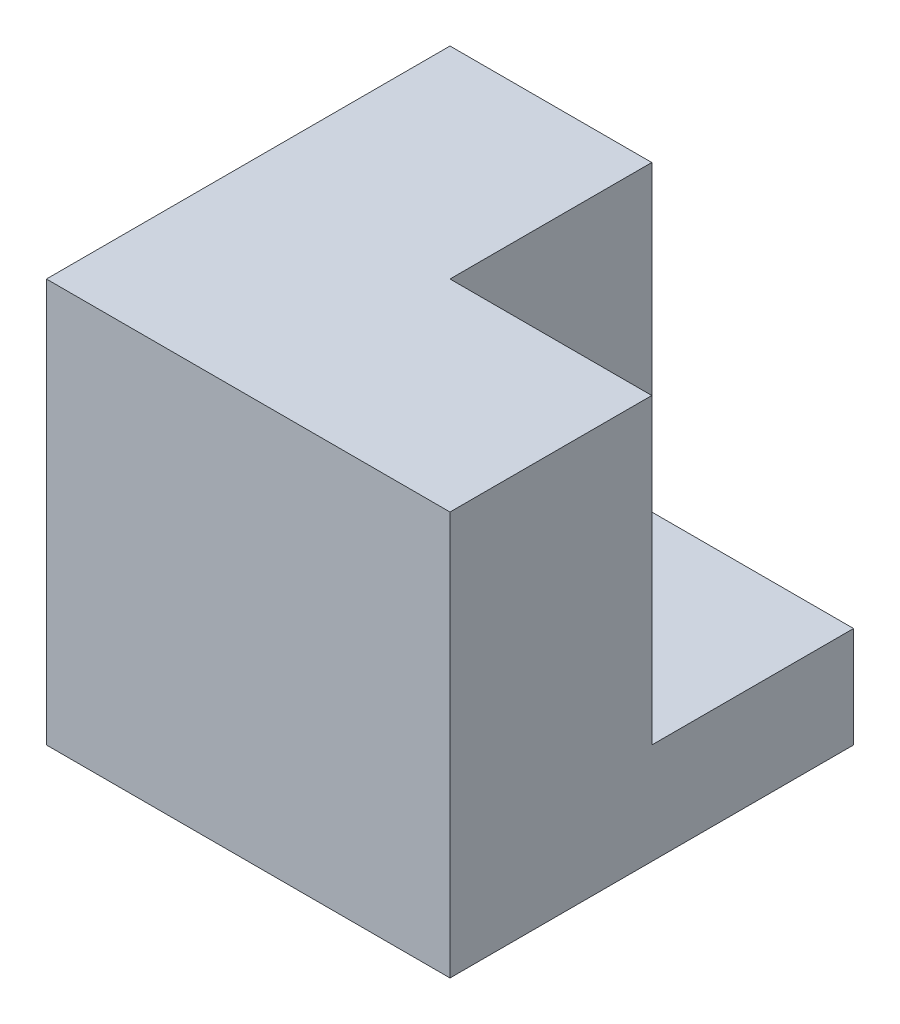
ISO-10303-21;
HEADER;
FILE_DESCRIPTION(('STEP AP214'),'2;1');
FILE_NAME('part.step','',(''),(''),'','','');
FILE_SCHEMA(('AUTOMOTIVE_DESIGN { 1 0 10303 214 1 1 1 1 }'));
ENDSEC;
DATA;
#1=APPLICATION_CONTEXT('core data for automotive mechanical design processes');
#2=APPLICATION_PROTOCOL_DEFINITION('international standard','automotive_design',2000,#1);
#3=PRODUCT_CONTEXT('',#1,'mechanical');
#4=PRODUCT('Part','Part','',(#3));
#5=PRODUCT_RELATED_PRODUCT_CATEGORY('part','',(#4));
#6=PRODUCT_DEFINITION_FORMATION('','',#4);
#7=PRODUCT_DEFINITION_CONTEXT('part definition',#1,'design');
#8=PRODUCT_DEFINITION('design','',#6,#7);
#9=PRODUCT_DEFINITION_SHAPE('','',#8);
#10=(LENGTH_UNIT() NAMED_UNIT(*) SI_UNIT(.MILLI.,.METRE.));
#11=(NAMED_UNIT(*) PLANE_ANGLE_UNIT() SI_UNIT($,.RADIAN.));
#12=(NAMED_UNIT(*) SI_UNIT($,.STERADIAN.) SOLID_ANGLE_UNIT());
#13=UNCERTAINTY_MEASURE_WITH_UNIT(LENGTH_MEASURE(1.E-05),#10,'distance_accuracy_value','');
#14=(GEOMETRIC_REPRESENTATION_CONTEXT(3) GLOBAL_UNCERTAINTY_ASSIGNED_CONTEXT((#13)) GLOBAL_UNIT_ASSIGNED_CONTEXT((#10,
#11,#12)) REPRESENTATION_CONTEXT('',''));
#15=CARTESIAN_POINT('',(0.,0.,0.));
#16=DIRECTION('',(0.,0.,1.));
#17=DIRECTION('',(1.,0.,0.));
#18=AXIS2_PLACEMENT_3D('',#15,#16,#17);
#19=CARTESIAN_POINT('',(0.,0.,76.2));
#20=DIRECTION('',(1.,0.,0.));
#21=DIRECTION('',(0.,0.,-1.));
#22=AXIS2_PLACEMENT_3D('',#19,#20,#21);
#23=PLANE('',#22);
#24=DIRECTION('',(0.,-1.,0.));
#25=VECTOR('',#24,1.);
#26=CARTESIAN_POINT('',(0.,0.,0.));
#27=LINE('',#26,#25);
#28=CARTESIAN_POINT('',(0.,76.2,0.));
#29=VERTEX_POINT('',#28);
#30=CARTESIAN_POINT('',(0.,0.,0.));
#31=VERTEX_POINT('',#30);
#32=EDGE_CURVE('E125',#29,#31,#27,.T.);
#33=ORIENTED_EDGE('',*,*,#32,.T.);
#34=DIRECTION('',(0.,0.,-1.));
#35=VECTOR('',#34,1.);
#36=CARTESIAN_POINT('',(0.,0.,76.2));
#37=LINE('',#36,#35);
#38=CARTESIAN_POINT('',(0.,0.,76.2));
#39=VERTEX_POINT('',#38);
#40=EDGE_CURVE('E11',#39,#31,#37,.T.);
#41=ORIENTED_EDGE('',*,*,#40,.F.);
#42=DIRECTION('',(0.,-1.,0.));
#43=VECTOR('',#42,1.);
#44=CARTESIAN_POINT('',(0.,0.,76.2));
#45=LINE('',#44,#43);
#46=CARTESIAN_POINT('',(0.,76.2,76.2));
#47=VERTEX_POINT('',#46);
#48=EDGE_CURVE('E127',#47,#39,#45,.T.);
#49=ORIENTED_EDGE('',*,*,#48,.F.);
#50=DIRECTION('',(0.,0.,-1.));
#51=VECTOR('',#50,1.);
#52=CARTESIAN_POINT('',(0.,76.2,76.2));
#53=LINE('',#52,#51);
#54=EDGE_CURVE('E138',#47,#29,#53,.T.);
#55=ORIENTED_EDGE('',*,*,#54,.T.);
#56=EDGE_LOOP('',(#33,#41,#49,#55));
#57=FACE_BOUND('',#56,.T.);
#58=ADVANCED_FACE('F39',(#57),#23,.F.);
#59=CARTESIAN_POINT('',(0.,0.,76.2));
#60=DIRECTION('',(0.,1.,0.));
#61=DIRECTION('',(-1.,0.,0.));
#62=AXIS2_PLACEMENT_3D('',#59,#60,#61);
#63=PLANE('',#62);
#64=DIRECTION('',(1.,0.,0.));
#65=VECTOR('',#64,1.);
#66=CARTESIAN_POINT('',(0.,0.,0.));
#67=LINE('',#66,#65);
#68=CARTESIAN_POINT('',(76.2,0.,0.));
#69=VERTEX_POINT('',#68);
#70=EDGE_CURVE('E134',#31,#69,#67,.T.);
#71=ORIENTED_EDGE('',*,*,#70,.T.);
#72=DIRECTION('',(0.,0.,-1.));
#73=VECTOR('',#72,1.);
#74=CARTESIAN_POINT('',(76.2,0.,76.2));
#75=LINE('',#74,#73);
#76=CARTESIAN_POINT('',(76.2,0.,76.2));
#77=VERTEX_POINT('',#76);
#78=EDGE_CURVE('E47',#77,#69,#75,.T.);
#79=ORIENTED_EDGE('',*,*,#78,.F.);
#80=DIRECTION('',(1.,0.,0.));
#81=VECTOR('',#80,1.);
#82=CARTESIAN_POINT('',(0.,0.,76.2));
#83=LINE('',#82,#81);
#84=EDGE_CURVE('E88',#39,#77,#83,.T.);
#85=ORIENTED_EDGE('',*,*,#84,.F.);
#86=ORIENTED_EDGE('',*,*,#40,.T.);
#87=EDGE_LOOP('',(#71,#79,#85,#86));
#88=FACE_BOUND('',#87,.T.);
#89=ADVANCED_FACE('F172',(#88),#63,.F.);
#90=CARTESIAN_POINT('',(76.2,0.,76.2));
#91=DIRECTION('',(-1.,0.,0.));
#92=DIRECTION('',(0.,0.,1.));
#93=AXIS2_PLACEMENT_3D('',#90,#91,#92);
#94=PLANE('',#93);
#95=DIRECTION('',(0.,1.,0.));
#96=VECTOR('',#95,1.);
#97=CARTESIAN_POINT('',(76.2,0.,0.));
#98=LINE('',#97,#96);
#99=CARTESIAN_POINT('',(76.2,19.05,0.));
#100=VERTEX_POINT('',#99);
#101=EDGE_CURVE('E128',#69,#100,#98,.T.);
#102=ORIENTED_EDGE('',*,*,#101,.T.);
#103=DIRECTION('',(0.,0.,-1.));
#104=VECTOR('',#103,1.);
#105=CARTESIAN_POINT('',(76.2,19.05,0.));
#106=LINE('',#105,#104);
#107=CARTESIAN_POINT('',(76.2,19.05,38.1));
#108=VERTEX_POINT('',#107);
#109=EDGE_CURVE('E114',#108,#100,#106,.T.);
#110=ORIENTED_EDGE('',*,*,#109,.F.);
#111=DIRECTION('',(0.,-1.,0.));
#112=VECTOR('',#111,1.);
#113=CARTESIAN_POINT('',(76.2,76.2,38.1));
#114=LINE('',#113,#112);
#115=CARTESIAN_POINT('',(76.2,76.2,38.1));
#116=VERTEX_POINT('',#115);
#117=EDGE_CURVE('E178',#116,#108,#114,.T.);
#118=ORIENTED_EDGE('',*,*,#117,.F.);
#119=DIRECTION('',(0.,0.,-1.));
#120=VECTOR('',#119,1.);
#121=CARTESIAN_POINT('',(76.2,76.2,76.2));
#122=LINE('',#121,#120);
#123=CARTESIAN_POINT('',(76.2,76.2,76.2));
#124=VERTEX_POINT('',#123);
#125=EDGE_CURVE('E141',#124,#116,#122,.T.);
#126=ORIENTED_EDGE('',*,*,#125,.F.);
#127=DIRECTION('',(0.,1.,0.));
#128=VECTOR('',#127,1.);
#129=CARTESIAN_POINT('',(76.2,0.,76.2));
#130=LINE('',#129,#128);
#131=EDGE_CURVE('E151',#77,#124,#130,.T.);
#132=ORIENTED_EDGE('',*,*,#131,.F.);
#133=ORIENTED_EDGE('',*,*,#78,.T.);
#134=EDGE_LOOP('',(#102,#110,#118,#126,#132,#133));
#135=FACE_BOUND('',#134,.T.);
#136=ADVANCED_FACE('F148',(#135),#94,.F.);
#137=CARTESIAN_POINT('',(0.,76.2,76.2));
#138=DIRECTION('',(0.,-1.,0.));
#139=DIRECTION('',(1.,0.,0.));
#140=AXIS2_PLACEMENT_3D('',#137,#138,#139);
#141=PLANE('',#140);
#142=ORIENTED_EDGE('',*,*,#125,.T.);
#143=DIRECTION('',(1.,0.,0.));
#144=VECTOR('',#143,1.);
#145=CARTESIAN_POINT('',(38.1,76.2,38.1));
#146=LINE('',#145,#144);
#147=CARTESIAN_POINT('',(38.1,76.2,38.1));
#148=VERTEX_POINT('',#147);
#149=EDGE_CURVE('E118',#148,#116,#146,.T.);
#150=ORIENTED_EDGE('',*,*,#149,.F.);
#151=DIRECTION('',(0.,0.,1.));
#152=VECTOR('',#151,1.);
#153=CARTESIAN_POINT('',(38.1,76.2,0.));
#154=LINE('',#153,#152);
#155=CARTESIAN_POINT('',(38.1,76.2,0.));
#156=VERTEX_POINT('',#155);
#157=EDGE_CURVE('E109',#156,#148,#154,.T.);
#158=ORIENTED_EDGE('',*,*,#157,.F.);
#159=DIRECTION('',(-1.,0.,0.));
#160=VECTOR('',#159,1.);
#161=CARTESIAN_POINT('',(0.,76.2,0.));
#162=LINE('',#161,#160);
#163=EDGE_CURVE('E81',#156,#29,#162,.T.);
#164=ORIENTED_EDGE('',*,*,#163,.T.);
#165=ORIENTED_EDGE('',*,*,#54,.F.);
#166=DIRECTION('',(-1.,0.,0.));
#167=VECTOR('',#166,1.);
#168=CARTESIAN_POINT('',(0.,76.2,76.2));
#169=LINE('',#168,#167);
#170=EDGE_CURVE('E63',#124,#47,#169,.T.);
#171=ORIENTED_EDGE('',*,*,#170,.F.);
#172=EDGE_LOOP('',(#142,#150,#158,#164,#165,#171));
#173=FACE_BOUND('',#172,.T.);
#174=ADVANCED_FACE('F117',(#173),#141,.F.);
#175=CARTESIAN_POINT('',(0.,0.,76.2));
#176=DIRECTION('',(0.,0.,-1.));
#177=DIRECTION('',(-1.,0.,0.));
#178=AXIS2_PLACEMENT_3D('',#175,#176,#177);
#179=PLANE('',#178);
#180=ORIENTED_EDGE('',*,*,#48,.T.);
#181=ORIENTED_EDGE('',*,*,#84,.T.);
#182=ORIENTED_EDGE('',*,*,#131,.T.);
#183=ORIENTED_EDGE('',*,*,#170,.T.);
#184=EDGE_LOOP('',(#180,#181,#182,#183));
#185=FACE_BOUND('',#184,.T.);
#186=ADVANCED_FACE('F208',(#185),#179,.F.);
#187=CARTESIAN_POINT('',(0.,0.,0.));
#188=DIRECTION('',(0.,0.,-1.));
#189=DIRECTION('',(-1.,0.,0.));
#190=AXIS2_PLACEMENT_3D('',#187,#188,#189);
#191=PLANE('',#190);
#192=DIRECTION('',(1.,0.,0.));
#193=VECTOR('',#192,1.);
#194=CARTESIAN_POINT('',(38.1,19.05,0.));
#195=LINE('',#194,#193);
#196=CARTESIAN_POINT('',(38.1,19.05,0.));
#197=VERTEX_POINT('',#196);
#198=EDGE_CURVE('E152',#197,#100,#195,.T.);
#199=ORIENTED_EDGE('',*,*,#198,.T.);
#200=ORIENTED_EDGE('',*,*,#101,.F.);
#201=ORIENTED_EDGE('',*,*,#70,.F.);
#202=ORIENTED_EDGE('',*,*,#32,.F.);
#203=ORIENTED_EDGE('',*,*,#163,.F.);
#204=DIRECTION('',(0.,1.,0.));
#205=VECTOR('',#204,1.);
#206=CARTESIAN_POINT('',(38.1,76.2,0.));
#207=LINE('',#206,#205);
#208=EDGE_CURVE('E107',#197,#156,#207,.T.);
#209=ORIENTED_EDGE('',*,*,#208,.F.);
#210=EDGE_LOOP('',(#199,#200,#201,#202,#203,#209));
#211=FACE_BOUND('',#210,.T.);
#212=ADVANCED_FACE('F123',(#211),#191,.T.);
#213=CARTESIAN_POINT('',(38.1,19.05,0.));
#214=DIRECTION('',(0.,-1.,0.));
#215=DIRECTION('',(0.,0.,-1.));
#216=AXIS2_PLACEMENT_3D('',#213,#214,#215);
#217=PLANE('',#216);
#218=ORIENTED_EDGE('',*,*,#109,.T.);
#219=ORIENTED_EDGE('',*,*,#198,.F.);
#220=DIRECTION('',(0.,0.,-1.));
#221=VECTOR('',#220,1.);
#222=CARTESIAN_POINT('',(38.1,19.05,0.));
#223=LINE('',#222,#221);
#224=CARTESIAN_POINT('',(38.1,19.05,38.1));
#225=VERTEX_POINT('',#224);
#226=EDGE_CURVE('E54',#225,#197,#223,.T.);
#227=ORIENTED_EDGE('',*,*,#226,.F.);
#228=DIRECTION('',(1.,0.,0.));
#229=VECTOR('',#228,1.);
#230=CARTESIAN_POINT('',(38.1,19.05,38.1));
#231=LINE('',#230,#229);
#232=EDGE_CURVE('E155',#225,#108,#231,.T.);
#233=ORIENTED_EDGE('',*,*,#232,.T.);
#234=EDGE_LOOP('',(#218,#219,#227,#233));
#235=FACE_BOUND('',#234,.T.);
#236=ADVANCED_FACE('F186',(#235),#217,.F.);
#237=CARTESIAN_POINT('',(38.1,76.2,38.1));
#238=DIRECTION('',(0.,0.,1.));
#239=DIRECTION('',(0.,-1.,0.));
#240=AXIS2_PLACEMENT_3D('',#237,#238,#239);
#241=PLANE('',#240);
#242=ORIENTED_EDGE('',*,*,#117,.T.);
#243=ORIENTED_EDGE('',*,*,#232,.F.);
#244=DIRECTION('',(0.,-1.,0.));
#245=VECTOR('',#244,1.);
#246=CARTESIAN_POINT('',(38.1,76.2,38.1));
#247=LINE('',#246,#245);
#248=EDGE_CURVE('E120',#148,#225,#247,.T.);
#249=ORIENTED_EDGE('',*,*,#248,.F.);
#250=ORIENTED_EDGE('',*,*,#149,.T.);
#251=EDGE_LOOP('',(#242,#243,#249,#250));
#252=FACE_BOUND('',#251,.T.);
#253=ADVANCED_FACE('F187',(#252),#241,.F.);
#254=CARTESIAN_POINT('',(38.1,0.,0.));
#255=DIRECTION('',(-1.,0.,0.));
#256=DIRECTION('',(0.,0.,1.));
#257=AXIS2_PLACEMENT_3D('',#254,#255,#256);
#258=PLANE('',#257);
#259=ORIENTED_EDGE('',*,*,#208,.T.);
#260=ORIENTED_EDGE('',*,*,#157,.T.);
#261=ORIENTED_EDGE('',*,*,#248,.T.);
#262=ORIENTED_EDGE('',*,*,#226,.T.);
#263=EDGE_LOOP('',(#259,#260,#261,#262));
#264=FACE_BOUND('',#263,.T.);
#265=ADVANCED_FACE('F108',(#264),#258,.F.);
#266=CLOSED_SHELL('',(#58,#89,#136,#174,#186,#212,#236,#253,#265));
#267=MANIFOLD_SOLID_BREP('B2',#266);
#268=ADVANCED_BREP_SHAPE_REPRESENTATION('',(#18,#267),#14);
#269=SHAPE_DEFINITION_REPRESENTATION(#9,#268);
ENDSEC;
END-ISO-10303-21;
